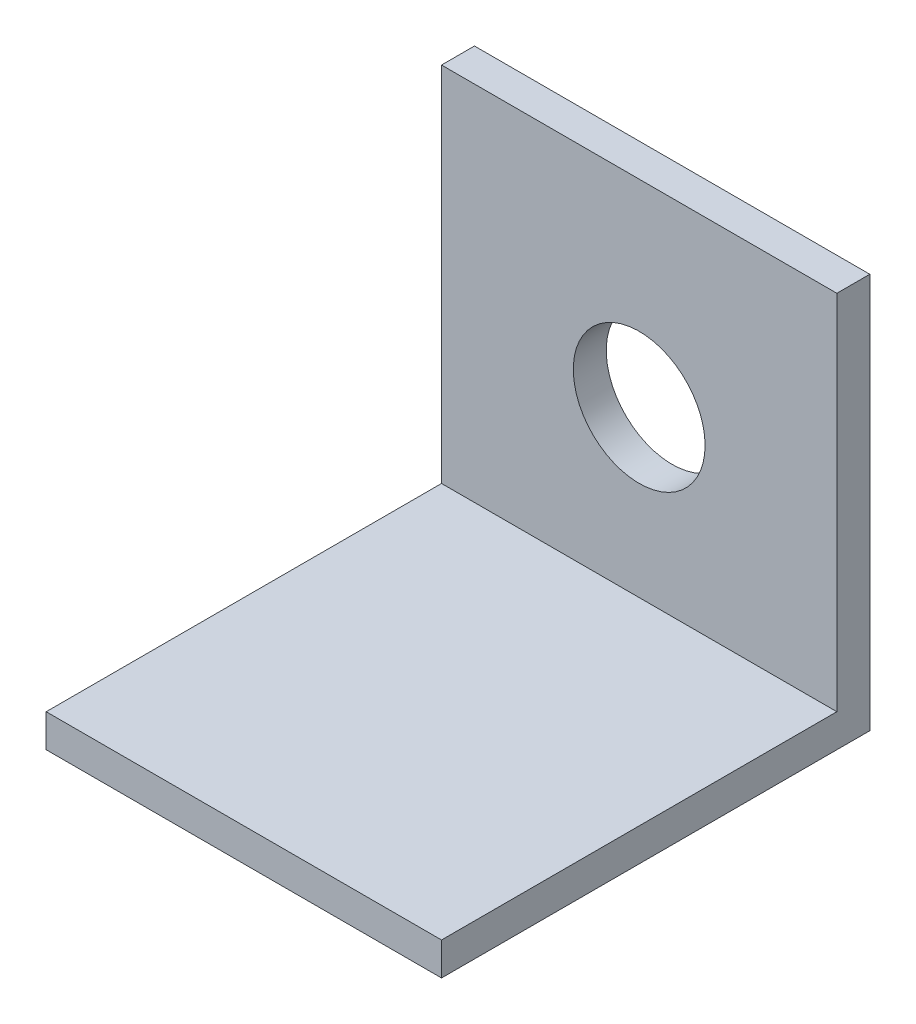
ISO-10303-21;
HEADER;
FILE_DESCRIPTION(('STEP AP214'),'2;1');
FILE_NAME('part.step','',(''),(''),'','','');
FILE_SCHEMA(('AUTOMOTIVE_DESIGN { 1 0 10303 214 1 1 1 1 }'));
ENDSEC;
DATA;
#1=APPLICATION_CONTEXT('core data for automotive mechanical design processes');
#2=APPLICATION_PROTOCOL_DEFINITION('international standard','automotive_design',2000,#1);
#3=PRODUCT_CONTEXT('',#1,'mechanical');
#4=PRODUCT('Part','Part','',(#3));
#5=PRODUCT_RELATED_PRODUCT_CATEGORY('part','',(#4));
#6=PRODUCT_DEFINITION_FORMATION('','',#4);
#7=PRODUCT_DEFINITION_CONTEXT('part definition',#1,'design');
#8=PRODUCT_DEFINITION('design','',#6,#7);
#9=PRODUCT_DEFINITION_SHAPE('','',#8);
#10=(LENGTH_UNIT() NAMED_UNIT(*) SI_UNIT(.MILLI.,.METRE.));
#11=(NAMED_UNIT(*) PLANE_ANGLE_UNIT() SI_UNIT($,.RADIAN.));
#12=(NAMED_UNIT(*) SI_UNIT($,.STERADIAN.) SOLID_ANGLE_UNIT());
#13=UNCERTAINTY_MEASURE_WITH_UNIT(LENGTH_MEASURE(1.E-05),#10,'distance_accuracy_value','');
#14=(GEOMETRIC_REPRESENTATION_CONTEXT(3) GLOBAL_UNCERTAINTY_ASSIGNED_CONTEXT((#13)) GLOBAL_UNIT_ASSIGNED_CONTEXT((#10,
#11,#12)) REPRESENTATION_CONTEXT('',''));
#15=CARTESIAN_POINT('',(0.,0.,0.));
#16=DIRECTION('',(0.,0.,1.));
#17=DIRECTION('',(1.,0.,0.));
#18=AXIS2_PLACEMENT_3D('',#15,#16,#17);
#19=CARTESIAN_POINT('',(0.,0.,0.79375));
#20=DIRECTION('',(0.,0.,1.));
#21=DIRECTION('',(1.,0.,0.));
#22=AXIS2_PLACEMENT_3D('',#19,#20,#21);
#23=PLANE('',#22);
#24=CARTESIAN_POINT('',(0.,0.,0.79375));
#25=DIRECTION('',(0.,0.,1.));
#26=DIRECTION('',(1.,0.,0.));
#27=AXIS2_PLACEMENT_3D('',#24,#25,#26);
#28=CIRCLE('',#27,3.175);
#29=CARTESIAN_POINT('',(3.175,0.,0.79375));
#30=VERTEX_POINT('',#29);
#31=EDGE_CURVE('E114',#30,#30,#28,.T.);
#32=ORIENTED_EDGE('',*,*,#31,.F.);
#33=EDGE_LOOP('',(#32));
#34=FACE_BOUND('',#33,.T.);
#35=DIRECTION('',(0.,-1.,0.));
#36=VECTOR('',#35,1.);
#37=CARTESIAN_POINT('',(-9.525,9.525,0.79375));
#38=LINE('',#37,#36);
#39=CARTESIAN_POINT('',(-9.525,9.525,0.79375));
#40=VERTEX_POINT('',#39);
#41=CARTESIAN_POINT('',(-9.525,-7.9375,0.79375));
#42=VERTEX_POINT('',#41);
#43=EDGE_CURVE('E108',#40,#42,#38,.T.);
#44=ORIENTED_EDGE('',*,*,#43,.T.);
#45=DIRECTION('',(1.,0.,0.));
#46=VECTOR('',#45,1.);
#47=CARTESIAN_POINT('',(-9.525,-7.9375,0.79375));
#48=LINE('',#47,#46);
#49=CARTESIAN_POINT('',(9.525,-7.93749999999999,0.79375));
#50=VERTEX_POINT('',#49);
#51=EDGE_CURVE('E161',#42,#50,#48,.T.);
#52=ORIENTED_EDGE('',*,*,#51,.T.);
#53=DIRECTION('',(0.,1.,0.));
#54=VECTOR('',#53,1.);
#55=CARTESIAN_POINT('',(9.525,9.525,0.79375));
#56=LINE('',#55,#54);
#57=CARTESIAN_POINT('',(9.525,9.525,0.79375));
#58=VERTEX_POINT('',#57);
#59=EDGE_CURVE('E97',#50,#58,#56,.T.);
#60=ORIENTED_EDGE('',*,*,#59,.T.);
#61=DIRECTION('',(-1.,0.,0.));
#62=VECTOR('',#61,1.);
#63=CARTESIAN_POINT('',(-9.525,9.525,0.79375));
#64=LINE('',#63,#62);
#65=EDGE_CURVE('E64',#58,#40,#64,.T.);
#66=ORIENTED_EDGE('',*,*,#65,.T.);
#67=EDGE_LOOP('',(#44,#52,#60,#66));
#68=FACE_BOUND('',#67,.T.);
#69=ADVANCED_FACE('F39',(#34,#68),#23,.T.);
#70=CARTESIAN_POINT('',(0.,0.,-0.79375));
#71=DIRECTION('',(0.,0.,1.));
#72=DIRECTION('',(1.,0.,0.));
#73=AXIS2_PLACEMENT_3D('',#70,#71,#72);
#74=PLANE('',#73);
#75=DIRECTION('',(0.,1.,0.));
#76=VECTOR('',#75,1.);
#77=CARTESIAN_POINT('',(9.525,9.525,-0.79375));
#78=LINE('',#77,#76);
#79=CARTESIAN_POINT('',(9.525,-9.525,-0.79375));
#80=VERTEX_POINT('',#79);
#81=CARTESIAN_POINT('',(9.525,9.525,-0.79375));
#82=VERTEX_POINT('',#81);
#83=EDGE_CURVE('E103',#80,#82,#78,.T.);
#84=ORIENTED_EDGE('',*,*,#83,.F.);
#85=DIRECTION('',(1.,0.,0.));
#86=VECTOR('',#85,1.);
#87=CARTESIAN_POINT('',(-9.525,-9.525,-0.79375));
#88=LINE('',#87,#86);
#89=CARTESIAN_POINT('',(-9.525,-9.525,-0.79375));
#90=VERTEX_POINT('',#89);
#91=EDGE_CURVE('E84',#90,#80,#88,.T.);
#92=ORIENTED_EDGE('',*,*,#91,.F.);
#93=DIRECTION('',(0.,-1.,0.));
#94=VECTOR('',#93,1.);
#95=CARTESIAN_POINT('',(-9.525,9.525,-0.79375));
#96=LINE('',#95,#94);
#97=CARTESIAN_POINT('',(-9.525,9.525,-0.79375));
#98=VERTEX_POINT('',#97);
#99=EDGE_CURVE('E98',#98,#90,#96,.T.);
#100=ORIENTED_EDGE('',*,*,#99,.F.);
#101=DIRECTION('',(-1.,0.,0.));
#102=VECTOR('',#101,1.);
#103=CARTESIAN_POINT('',(-9.525,9.525,-0.79375));
#104=LINE('',#103,#102);
#105=EDGE_CURVE('E112',#82,#98,#104,.T.);
#106=ORIENTED_EDGE('',*,*,#105,.F.);
#107=EDGE_LOOP('',(#84,#92,#100,#106));
#108=FACE_BOUND('',#107,.T.);
#109=CARTESIAN_POINT('',(0.,0.,-0.79375));
#110=DIRECTION('',(0.,0.,1.));
#111=DIRECTION('',(1.,0.,0.));
#112=AXIS2_PLACEMENT_3D('',#109,#110,#111);
#113=CIRCLE('',#112,3.175);
#114=CARTESIAN_POINT('',(3.175,0.,-0.79375));
#115=VERTEX_POINT('',#114);
#116=EDGE_CURVE('E120',#115,#115,#113,.T.);
#117=ORIENTED_EDGE('',*,*,#116,.T.);
#118=EDGE_LOOP('',(#117));
#119=FACE_BOUND('',#118,.T.);
#120=ADVANCED_FACE('F110',(#108,#119),#74,.F.);
#121=CARTESIAN_POINT('',(9.525,9.525,0.79375));
#122=DIRECTION('',(-1.,0.,0.));
#123=DIRECTION('',(0.,0.,1.));
#124=AXIS2_PLACEMENT_3D('',#121,#122,#123);
#125=PLANE('',#124);
#126=ORIENTED_EDGE('',*,*,#83,.T.);
#127=DIRECTION('',(0.,0.,-1.));
#128=VECTOR('',#127,1.);
#129=CARTESIAN_POINT('',(9.525,9.525,0.79375));
#130=LINE('',#129,#128);
#131=EDGE_CURVE('E11',#58,#82,#130,.T.);
#132=ORIENTED_EDGE('',*,*,#131,.F.);
#133=ORIENTED_EDGE('',*,*,#59,.F.);
#134=DIRECTION('',(0.,0.,1.));
#135=VECTOR('',#134,1.);
#136=CARTESIAN_POINT('',(9.525,-7.9375,0.79375));
#137=LINE('',#136,#135);
#138=CARTESIAN_POINT('',(9.525,-7.9375,19.84375));
#139=VERTEX_POINT('',#138);
#140=EDGE_CURVE('E55',#50,#139,#137,.T.);
#141=ORIENTED_EDGE('',*,*,#140,.T.);
#142=DIRECTION('',(0.,-1.,0.));
#143=VECTOR('',#142,1.);
#144=CARTESIAN_POINT('',(9.525,-7.9375,19.84375));
#145=LINE('',#144,#143);
#146=CARTESIAN_POINT('',(9.525,-9.525,19.84375));
#147=VERTEX_POINT('',#146);
#148=EDGE_CURVE('E105',#139,#147,#145,.T.);
#149=ORIENTED_EDGE('',*,*,#148,.T.);
#150=DIRECTION('',(0.,0.,-1.));
#151=VECTOR('',#150,1.);
#152=CARTESIAN_POINT('',(9.525,-9.525,0.79375));
#153=LINE('',#152,#151);
#154=EDGE_CURVE('E89',#147,#80,#153,.T.);
#155=ORIENTED_EDGE('',*,*,#154,.T.);
#156=EDGE_LOOP('',(#126,#132,#133,#141,#149,#155));
#157=FACE_BOUND('',#156,.T.);
#158=ADVANCED_FACE('F41',(#157),#125,.F.);
#159=CARTESIAN_POINT('',(-9.525,9.525,0.79375));
#160=DIRECTION('',(0.,-1.,0.));
#161=DIRECTION('',(0.,0.,-1.));
#162=AXIS2_PLACEMENT_3D('',#159,#160,#161);
#163=PLANE('',#162);
#164=ORIENTED_EDGE('',*,*,#105,.T.);
#165=DIRECTION('',(0.,0.,-1.));
#166=VECTOR('',#165,1.);
#167=CARTESIAN_POINT('',(-9.525,9.525,0.79375));
#168=LINE('',#167,#166);
#169=EDGE_CURVE('E48',#40,#98,#168,.T.);
#170=ORIENTED_EDGE('',*,*,#169,.F.);
#171=ORIENTED_EDGE('',*,*,#65,.F.);
#172=ORIENTED_EDGE('',*,*,#131,.T.);
#173=EDGE_LOOP('',(#164,#170,#171,#172));
#174=FACE_BOUND('',#173,.T.);
#175=ADVANCED_FACE('F135',(#174),#163,.F.);
#176=CARTESIAN_POINT('',(-9.525,9.525,0.79375));
#177=DIRECTION('',(1.,0.,0.));
#178=DIRECTION('',(0.,0.,-1.));
#179=AXIS2_PLACEMENT_3D('',#176,#177,#178);
#180=PLANE('',#179);
#181=ORIENTED_EDGE('',*,*,#99,.T.);
#182=DIRECTION('',(0.,0.,-1.));
#183=VECTOR('',#182,1.);
#184=CARTESIAN_POINT('',(-9.525,-9.525,0.79375));
#185=LINE('',#184,#183);
#186=CARTESIAN_POINT('',(-9.525,-9.525,19.84375));
#187=VERTEX_POINT('',#186);
#188=EDGE_CURVE('E92',#187,#90,#185,.T.);
#189=ORIENTED_EDGE('',*,*,#188,.F.);
#190=DIRECTION('',(0.,-1.,0.));
#191=VECTOR('',#190,1.);
#192=CARTESIAN_POINT('',(-9.525,-7.9375,19.84375));
#193=LINE('',#192,#191);
#194=CARTESIAN_POINT('',(-9.525,-7.9375,19.84375));
#195=VERTEX_POINT('',#194);
#196=EDGE_CURVE('E144',#195,#187,#193,.T.);
#197=ORIENTED_EDGE('',*,*,#196,.F.);
#198=DIRECTION('',(0.,0.,-1.));
#199=VECTOR('',#198,1.);
#200=CARTESIAN_POINT('',(-9.525,-7.9375,0.79375));
#201=LINE('',#200,#199);
#202=EDGE_CURVE('E155',#195,#42,#201,.T.);
#203=ORIENTED_EDGE('',*,*,#202,.T.);
#204=ORIENTED_EDGE('',*,*,#43,.F.);
#205=ORIENTED_EDGE('',*,*,#169,.T.);
#206=EDGE_LOOP('',(#181,#189,#197,#203,#204,#205));
#207=FACE_BOUND('',#206,.T.);
#208=ADVANCED_FACE('F132',(#207),#180,.F.);
#209=CARTESIAN_POINT('',(-9.525,-9.525,0.79375));
#210=DIRECTION('',(0.,1.,0.));
#211=DIRECTION('',(0.,0.,1.));
#212=AXIS2_PLACEMENT_3D('',#209,#210,#211);
#213=PLANE('',#212);
#214=ORIENTED_EDGE('',*,*,#91,.T.);
#215=ORIENTED_EDGE('',*,*,#154,.F.);
#216=DIRECTION('',(-1.,0.,0.));
#217=VECTOR('',#216,1.);
#218=CARTESIAN_POINT('',(-9.525,-9.525,19.84375));
#219=LINE('',#218,#217);
#220=EDGE_CURVE('E152',#147,#187,#219,.T.);
#221=ORIENTED_EDGE('',*,*,#220,.T.);
#222=ORIENTED_EDGE('',*,*,#188,.T.);
#223=EDGE_LOOP('',(#214,#215,#221,#222));
#224=FACE_BOUND('',#223,.T.);
#225=ADVANCED_FACE('F86',(#224),#213,.F.);
#226=CARTESIAN_POINT('',(0.,0.,0.79375));
#227=DIRECTION('',(0.,0.,-1.));
#228=DIRECTION('',(-1.,0.,0.));
#229=AXIS2_PLACEMENT_3D('',#226,#227,#228);
#230=CYLINDRICAL_SURFACE('',#229,3.175);
#231=ORIENTED_EDGE('',*,*,#31,.T.);
#232=EDGE_LOOP('',(#231));
#233=FACE_BOUND('',#232,.T.);
#234=ORIENTED_EDGE('',*,*,#116,.F.);
#235=EDGE_LOOP('',(#234));
#236=FACE_BOUND('',#235,.T.);
#237=ADVANCED_FACE('F178',(#233,#236),#230,.F.);
#238=CARTESIAN_POINT('',(-9.525,-7.9375,19.84375));
#239=DIRECTION('',(0.,0.,1.));
#240=DIRECTION('',(1.,0.,0.));
#241=AXIS2_PLACEMENT_3D('',#238,#239,#240);
#242=PLANE('',#241);
#243=ORIENTED_EDGE('',*,*,#220,.F.);
#244=ORIENTED_EDGE('',*,*,#148,.F.);
#245=DIRECTION('',(-1.,0.,0.));
#246=VECTOR('',#245,1.);
#247=CARTESIAN_POINT('',(-9.525,-7.9375,19.84375));
#248=LINE('',#247,#246);
#249=EDGE_CURVE('E148',#139,#195,#248,.T.);
#250=ORIENTED_EDGE('',*,*,#249,.T.);
#251=ORIENTED_EDGE('',*,*,#196,.T.);
#252=EDGE_LOOP('',(#243,#244,#250,#251));
#253=FACE_BOUND('',#252,.T.);
#254=ADVANCED_FACE('F173',(#253),#242,.T.);
#255=CARTESIAN_POINT('',(0.,-7.9375,0.));
#256=DIRECTION('',(0.,1.,0.));
#257=DIRECTION('',(0.,0.,1.));
#258=AXIS2_PLACEMENT_3D('',#255,#256,#257);
#259=PLANE('',#258);
#260=ORIENTED_EDGE('',*,*,#202,.F.);
#261=ORIENTED_EDGE('',*,*,#249,.F.);
#262=ORIENTED_EDGE('',*,*,#140,.F.);
#263=ORIENTED_EDGE('',*,*,#51,.F.);
#264=EDGE_LOOP('',(#260,#261,#262,#263));
#265=FACE_BOUND('',#264,.T.);
#266=ADVANCED_FACE('F171',(#265),#259,.T.);
#267=CLOSED_SHELL('',(#69,#120,#158,#175,#208,#225,#237,#254,#266));
#268=MANIFOLD_SOLID_BREP('B2',#267);
#269=ADVANCED_BREP_SHAPE_REPRESENTATION('',(#18,#268),#14);
#270=SHAPE_DEFINITION_REPRESENTATION(#9,#269);
ENDSEC;
END-ISO-10303-21;
